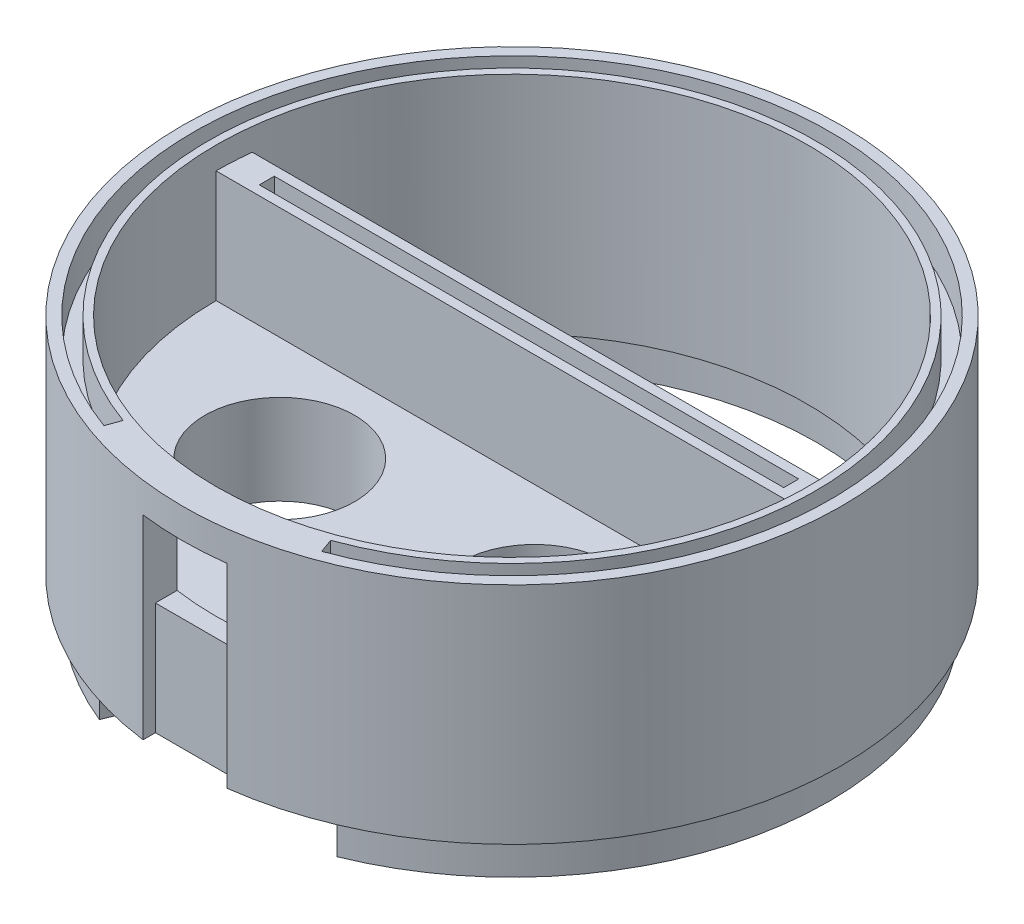
ISO-10303-21;
HEADER;
FILE_DESCRIPTION(('STEP AP214'),'2;1');
FILE_NAME('part.step','',(''),(''),'','','');
FILE_SCHEMA(('AUTOMOTIVE_DESIGN { 1 0 10303 214 1 1 1 1 }'));
ENDSEC;
DATA;
#1=APPLICATION_CONTEXT('core data for automotive mechanical design processes');
#2=APPLICATION_PROTOCOL_DEFINITION('international standard','automotive_design',2000,#1);
#3=PRODUCT_CONTEXT('',#1,'mechanical');
#4=PRODUCT('Part','Part','',(#3));
#5=PRODUCT_RELATED_PRODUCT_CATEGORY('part','',(#4));
#6=PRODUCT_DEFINITION_FORMATION('','',#4);
#7=PRODUCT_DEFINITION_CONTEXT('part definition',#1,'design');
#8=PRODUCT_DEFINITION('design','',#6,#7);
#9=PRODUCT_DEFINITION_SHAPE('','',#8);
#10=(LENGTH_UNIT() NAMED_UNIT(*) SI_UNIT(.MILLI.,.METRE.));
#11=(NAMED_UNIT(*) PLANE_ANGLE_UNIT() SI_UNIT($,.RADIAN.));
#12=(NAMED_UNIT(*) SI_UNIT($,.STERADIAN.) SOLID_ANGLE_UNIT());
#13=UNCERTAINTY_MEASURE_WITH_UNIT(LENGTH_MEASURE(1.E-05),#10,'distance_accuracy_value','');
#14=(GEOMETRIC_REPRESENTATION_CONTEXT(3) GLOBAL_UNCERTAINTY_ASSIGNED_CONTEXT((#13)) GLOBAL_UNIT_ASSIGNED_CONTEXT((#10,
#11,#12)) REPRESENTATION_CONTEXT('',''));
#15=CARTESIAN_POINT('',(0.,0.,0.));
#16=DIRECTION('',(0.,0.,1.));
#17=DIRECTION('',(1.,0.,0.));
#18=AXIS2_PLACEMENT_3D('',#15,#16,#17);
#19=CARTESIAN_POINT('',(0.,180.,0.));
#20=DIRECTION('',(0.,-1.,0.));
#21=DIRECTION('',(0.,0.,-1.));
#22=AXIS2_PLACEMENT_3D('',#19,#20,#21);
#23=CYLINDRICAL_SURFACE('',#22,44.);
#24=DIRECTION('',(0.,-1.,0.));
#25=VECTOR('',#24,1.);
#26=CARTESIAN_POINT('',(5.6,180.,43.6421814303547));
#27=LINE('',#26,#25);
#28=CARTESIAN_POINT('',(5.6,141.,43.6421814303547));
#29=VERTEX_POINT('',#28);
#30=CARTESIAN_POINT('',(5.6,167.,43.6421814303547));
#31=VERTEX_POINT('',#30);
#32=EDGE_CURVE('E356',#29,#31,#27,.F.);
#33=ORIENTED_EDGE('',*,*,#32,.F.);
#34=CARTESIAN_POINT('',(0.,141.,0.));
#35=DIRECTION('',(0.,1.,0.));
#36=DIRECTION('',(0.,0.,1.));
#37=AXIS2_PLACEMENT_3D('',#34,#35,#36);
#38=CIRCLE('',#37,44.);
#39=CARTESIAN_POINT('',(-5.6,141.,43.6421814303547));
#40=VERTEX_POINT('',#39);
#41=EDGE_CURVE('E290',#29,#40,#38,.T.);
#42=ORIENTED_EDGE('',*,*,#41,.T.);
#43=DIRECTION('',(0.,-1.,0.));
#44=VECTOR('',#43,1.);
#45=CARTESIAN_POINT('',(-5.6,180.,43.6421814303547));
#46=LINE('',#45,#44);
#47=CARTESIAN_POINT('',(-5.6,167.,43.6421814303547));
#48=VERTEX_POINT('',#47);
#49=EDGE_CURVE('E358',#48,#40,#46,.T.);
#50=ORIENTED_EDGE('',*,*,#49,.F.);
#51=CARTESIAN_POINT('',(0.,167.,0.));
#52=DIRECTION('',(0.,-1.,0.));
#53=DIRECTION('',(0.,0.,-1.));
#54=AXIS2_PLACEMENT_3D('',#51,#52,#53);
#55=CIRCLE('',#54,44.);
#56=EDGE_CURVE('E354',#31,#48,#55,.T.);
#57=ORIENTED_EDGE('',*,*,#56,.F.);
#58=EDGE_LOOP('',(#33,#42,#50,#57));
#59=FACE_BOUND('',#58,.T.);
#60=CARTESIAN_POINT('',(0.,171.,0.));
#61=DIRECTION('',(0.,1.,0.));
#62=DIRECTION('',(0.,0.,1.));
#63=AXIS2_PLACEMENT_3D('',#60,#61,#62);
#64=CIRCLE('',#63,44.);
#65=CARTESIAN_POINT('',(0.,171.,44.));
#66=VERTEX_POINT('',#65);
#67=EDGE_CURVE('E221',#66,#66,#64,.T.);
#68=ORIENTED_EDGE('',*,*,#67,.F.);
#69=EDGE_LOOP('',(#68));
#70=FACE_BOUND('',#69,.T.);
#71=ADVANCED_FACE('F36',(#59,#70),#23,.T.);
#72=CARTESIAN_POINT('',(0.,140.,0.));
#73=DIRECTION('',(0.,-1.,0.));
#74=DIRECTION('',(0.,0.,-1.));
#75=AXIS2_PLACEMENT_3D('',#72,#73,#74);
#76=CYLINDRICAL_SURFACE('',#75,39.5);
#77=CARTESIAN_POINT('',(0.,167.,0.));
#78=DIRECTION('',(0.,1.,0.));
#79=DIRECTION('',(0.,0.,1.));
#80=AXIS2_PLACEMENT_3D('',#77,#78,#79);
#81=CIRCLE('',#80,39.5);
#82=CARTESIAN_POINT('',(5.60000000000004,167.,39.10102300452));
#83=VERTEX_POINT('',#82);
#84=CARTESIAN_POINT('',(-5.6,167.,39.10102300452));
#85=VERTEX_POINT('',#84);
#86=EDGE_CURVE('E44',#83,#85,#81,.F.);
#87=ORIENTED_EDGE('',*,*,#86,.T.);
#88=DIRECTION('',(0.,1.,0.));
#89=VECTOR('',#88,1.);
#90=CARTESIAN_POINT('',(-5.6,168.,39.10102300452));
#91=LINE('',#90,#89);
#92=CARTESIAN_POINT('',(-5.6,156.,39.10102300452));
#93=VERTEX_POINT('',#92);
#94=EDGE_CURVE('E12',#85,#93,#91,.F.);
#95=ORIENTED_EDGE('',*,*,#94,.T.);
#96=CARTESIAN_POINT('',(0.,156.,0.));
#97=DIRECTION('',(0.,-1.,0.));
#98=DIRECTION('',(0.,0.,-1.));
#99=AXIS2_PLACEMENT_3D('',#96,#97,#98);
#100=CIRCLE('',#99,39.5);
#101=CARTESIAN_POINT('',(5.60000000000004,156.,39.10102300452));
#102=VERTEX_POINT('',#101);
#103=EDGE_CURVE('E364',#93,#102,#100,.F.);
#104=ORIENTED_EDGE('',*,*,#103,.T.);
#105=DIRECTION('',(0.,1.,0.));
#106=VECTOR('',#105,1.);
#107=CARTESIAN_POINT('',(5.60000000000004,168.,39.10102300452));
#108=LINE('',#107,#106);
#109=EDGE_CURVE('E367',#102,#83,#108,.T.);
#110=ORIENTED_EDGE('',*,*,#109,.T.);
#111=EDGE_LOOP('',(#87,#95,#104,#110));
#112=FACE_BOUND('',#111,.T.);
#113=CARTESIAN_POINT('',(0.,141.,0.));
#114=DIRECTION('',(0.,1.,0.));
#115=DIRECTION('',(0.,0.,1.));
#116=AXIS2_PLACEMENT_3D('',#113,#114,#115);
#117=CIRCLE('',#116,39.5);
#118=CARTESIAN_POINT('',(39.2349287961053,141.,-4.56840917219008));
#119=VERTEX_POINT('',#118);
#120=CARTESIAN_POINT('',(-39.2349287961053,141.,-4.56840917219008));
#121=VERTEX_POINT('',#120);
#122=EDGE_CURVE('E297',#119,#121,#117,.T.);
#123=ORIENTED_EDGE('',*,*,#122,.F.);
#124=DIRECTION('',(0.,1.,0.));
#125=VECTOR('',#124,1.);
#126=CARTESIAN_POINT('',(39.2349287961053,128.,-4.56840917219008));
#127=LINE('',#126,#125);
#128=CARTESIAN_POINT('',(39.2349287961053,168.,-4.56840917219008));
#129=VERTEX_POINT('',#128);
#130=EDGE_CURVE('E310',#119,#129,#127,.T.);
#131=ORIENTED_EDGE('',*,*,#130,.T.);
#132=CARTESIAN_POINT('',(0.,168.,0.));
#133=DIRECTION('',(0.,1.,0.));
#134=DIRECTION('',(0.,0.,1.));
#135=AXIS2_PLACEMENT_3D('',#132,#133,#134);
#136=CIRCLE('',#135,39.5);
#137=CARTESIAN_POINT('',(39.5,168.,0.));
#138=VERTEX_POINT('',#137);
#139=EDGE_CURVE('E342',#138,#129,#136,.T.);
#140=ORIENTED_EDGE('',*,*,#139,.F.);
#141=DIRECTION('',(0.,1.,0.));
#142=VECTOR('',#141,1.);
#143=CARTESIAN_POINT('',(39.5,153.,0.));
#144=LINE('',#143,#142);
#145=CARTESIAN_POINT('',(39.5,153.,0.));
#146=VERTEX_POINT('',#145);
#147=EDGE_CURVE('E336',#146,#138,#144,.T.);
#148=ORIENTED_EDGE('',*,*,#147,.F.);
#149=CARTESIAN_POINT('',(0.,153.,0.));
#150=DIRECTION('',(0.,1.,0.));
#151=DIRECTION('',(0.,0.,1.));
#152=AXIS2_PLACEMENT_3D('',#149,#150,#151);
#153=CIRCLE('',#152,39.5);
#154=CARTESIAN_POINT('',(-39.5,153.,0.));
#155=VERTEX_POINT('',#154);
#156=EDGE_CURVE('E330',#155,#146,#153,.T.);
#157=ORIENTED_EDGE('',*,*,#156,.F.);
#158=DIRECTION('',(0.,1.,0.));
#159=VECTOR('',#158,1.);
#160=CARTESIAN_POINT('',(-39.5,153.,0.));
#161=LINE('',#160,#159);
#162=CARTESIAN_POINT('',(-39.5,168.,0.));
#163=VERTEX_POINT('',#162);
#164=EDGE_CURVE('E337',#155,#163,#161,.T.);
#165=ORIENTED_EDGE('',*,*,#164,.T.);
#166=CARTESIAN_POINT('',(-39.2349287961053,168.,-4.56840917219008));
#167=VERTEX_POINT('',#166);
#168=EDGE_CURVE('E340',#167,#163,#136,.T.);
#169=ORIENTED_EDGE('',*,*,#168,.F.);
#170=DIRECTION('',(0.,1.,0.));
#171=VECTOR('',#170,1.);
#172=CARTESIAN_POINT('',(-39.2349287961053,128.,-4.56840917219008));
#173=LINE('',#172,#171);
#174=EDGE_CURVE('E309',#121,#167,#173,.T.);
#175=ORIENTED_EDGE('',*,*,#174,.F.);
#176=EDGE_LOOP('',(#123,#131,#140,#148,#157,#165,#169,#175));
#177=FACE_BOUND('',#176,.T.);
#178=CARTESIAN_POINT('',(0.,171.,0.));
#179=DIRECTION('',(0.,1.,0.));
#180=DIRECTION('',(0.,0.,1.));
#181=AXIS2_PLACEMENT_3D('',#178,#179,#180);
#182=CIRCLE('',#181,39.5);
#183=CARTESIAN_POINT('',(0.,171.,39.5));
#184=VERTEX_POINT('',#183);
#185=EDGE_CURVE('E39',#184,#184,#182,.T.);
#186=ORIENTED_EDGE('',*,*,#185,.T.);
#187=EDGE_LOOP('',(#186));
#188=FACE_BOUND('',#187,.T.);
#189=ADVANCED_FACE('F381',(#112,#177,#188),#76,.F.);
#190=CARTESIAN_POINT('',(0.,141.,0.));
#191=DIRECTION('',(0.,1.,0.));
#192=DIRECTION('',(0.,0.,1.));
#193=AXIS2_PLACEMENT_3D('',#190,#191,#192);
#194=PLANE('',#193);
#195=ORIENTED_EDGE('',*,*,#122,.T.);
#196=DIRECTION('',(-1.,0.,0.));
#197=VECTOR('',#196,1.);
#198=CARTESIAN_POINT('',(-34.7005711427845,141.,-4.56840917219008));
#199=LINE('',#198,#197);
#200=EDGE_CURVE('E299',#119,#121,#199,.T.);
#201=ORIENTED_EDGE('',*,*,#200,.F.);
#202=EDGE_LOOP('',(#195,#201));
#203=FACE_BOUND('',#202,.T.);
#204=CARTESIAN_POINT('',(17.,141.,14.));
#205=DIRECTION('',(0.,1.,0.));
#206=DIRECTION('',(0.,0.,1.));
#207=AXIS2_PLACEMENT_3D('',#204,#205,#206);
#208=CIRCLE('',#207,10.);
#209=CARTESIAN_POINT('',(17.,141.,24.));
#210=VERTEX_POINT('',#209);
#211=EDGE_CURVE('E294',#210,#210,#208,.F.);
#212=ORIENTED_EDGE('',*,*,#211,.F.);
#213=EDGE_LOOP('',(#212));
#214=FACE_BOUND('',#213,.T.);
#215=CARTESIAN_POINT('',(-17.,141.,14.));
#216=DIRECTION('',(0.,1.,0.));
#217=DIRECTION('',(0.,0.,1.));
#218=AXIS2_PLACEMENT_3D('',#215,#216,#217);
#219=CIRCLE('',#218,10.);
#220=CARTESIAN_POINT('',(-17.,141.,24.));
#221=VERTEX_POINT('',#220);
#222=EDGE_CURVE('E293',#221,#221,#219,.F.);
#223=ORIENTED_EDGE('',*,*,#222,.F.);
#224=EDGE_LOOP('',(#223));
#225=FACE_BOUND('',#224,.T.);
#226=DIRECTION('',(0.,0.,1.));
#227=VECTOR('',#226,1.);
#228=CARTESIAN_POINT('',(-5.6,141.,55.6));
#229=LINE('',#228,#227);
#230=CARTESIAN_POINT('',(-5.6,141.,42.));
#231=VERTEX_POINT('',#230);
#232=EDGE_CURVE('E307',#231,#40,#229,.T.);
#233=ORIENTED_EDGE('',*,*,#232,.T.);
#234=ORIENTED_EDGE('',*,*,#41,.F.);
#235=DIRECTION('',(0.,0.,-1.));
#236=VECTOR('',#235,1.);
#237=CARTESIAN_POINT('',(5.60000000000001,141.,55.6));
#238=LINE('',#237,#236);
#239=CARTESIAN_POINT('',(5.60000000000001,141.,42.));
#240=VERTEX_POINT('',#239);
#241=EDGE_CURVE('E302',#29,#240,#238,.T.);
#242=ORIENTED_EDGE('',*,*,#241,.T.);
#243=DIRECTION('',(1.,0.,0.));
#244=VECTOR('',#243,1.);
#245=CARTESIAN_POINT('',(0.,141.,42.));
#246=LINE('',#245,#244);
#247=EDGE_CURVE('E304',#231,#240,#246,.T.);
#248=ORIENTED_EDGE('',*,*,#247,.F.);
#249=EDGE_LOOP('',(#233,#234,#242,#248));
#250=FACE_BOUND('',#249,.T.);
#251=CARTESIAN_POINT('',(0.,141.,0.));
#252=DIRECTION('',(0.,1.,0.));
#253=DIRECTION('',(0.,0.,-1.));
#254=AXIS2_PLACEMENT_3D('',#251,#252,#253);
#255=CIRCLE('',#254,40.7);
#256=CARTESIAN_POINT('',(15.2464883520277,141.,37.7363828808682));
#257=VERTEX_POINT('',#256);
#258=CARTESIAN_POINT('',(-15.2464883520276,141.,37.7363828808682));
#259=VERTEX_POINT('',#258);
#260=EDGE_CURVE('E252',#257,#259,#255,.T.);
#261=ORIENTED_EDGE('',*,*,#260,.F.);
#262=DIRECTION('',(-0.374606593415912,0.,-0.927183854566788));
#263=VECTOR('',#262,1.);
#264=CARTESIAN_POINT('',(15.2464883520277,141.,37.7363828808682));
#265=LINE('',#264,#263);
#266=CARTESIAN_POINT('',(15.8458589014931,141.,39.2198770481751));
#267=VERTEX_POINT('',#266);
#268=EDGE_CURVE('E262',#267,#257,#265,.T.);
#269=ORIENTED_EDGE('',*,*,#268,.F.);
#270=CARTESIAN_POINT('',(0.,141.,0.));
#271=DIRECTION('',(0.,-1.,0.));
#272=DIRECTION('',(0.,0.,-1.));
#273=AXIS2_PLACEMENT_3D('',#270,#271,#272);
#274=CIRCLE('',#273,42.3);
#275=CARTESIAN_POINT('',(-15.8458589014931,141.,39.2198770481751));
#276=VERTEX_POINT('',#275);
#277=EDGE_CURVE('E274',#276,#267,#274,.T.);
#278=ORIENTED_EDGE('',*,*,#277,.F.);
#279=DIRECTION('',(-0.374606593415912,0.,0.927183854566788));
#280=VECTOR('',#279,1.);
#281=CARTESIAN_POINT('',(-15.2464883520277,141.,37.7363828808682));
#282=LINE('',#281,#280);
#283=EDGE_CURVE('E271',#259,#276,#282,.T.);
#284=ORIENTED_EDGE('',*,*,#283,.F.);
#285=EDGE_LOOP('',(#261,#269,#278,#284));
#286=FACE_BOUND('',#285,.T.);
#287=ADVANCED_FACE('F377',(#203,#214,#225,#250,#286),#194,.F.);
#288=CARTESIAN_POINT('',(0.,0.,42.));
#289=DIRECTION('',(0.,0.,-1.));
#290=DIRECTION('',(-1.,0.,0.));
#291=AXIS2_PLACEMENT_3D('',#288,#289,#290);
#292=PLANE('',#291);
#293=DIRECTION('',(0.,-1.,0.));
#294=VECTOR('',#293,1.);
#295=CARTESIAN_POINT('',(-5.6,10.2975033618753,42.));
#296=LINE('',#295,#294);
#297=CARTESIAN_POINT('',(-5.6,156.,42.));
#298=VERTEX_POINT('',#297);
#299=EDGE_CURVE('E345',#298,#231,#296,.T.);
#300=ORIENTED_EDGE('',*,*,#299,.T.);
#301=ORIENTED_EDGE('',*,*,#247,.T.);
#302=DIRECTION('',(0.,1.,0.));
#303=VECTOR('',#302,1.);
#304=CARTESIAN_POINT('',(5.60000000000004,10.2975033618753,42.));
#305=LINE('',#304,#303);
#306=CARTESIAN_POINT('',(5.60000000000004,156.,42.));
#307=VERTEX_POINT('',#306);
#308=EDGE_CURVE('E348',#240,#307,#305,.T.);
#309=ORIENTED_EDGE('',*,*,#308,.T.);
#310=DIRECTION('',(1.,0.,0.));
#311=VECTOR('',#310,1.);
#312=CARTESIAN_POINT('',(-5.6,156.,42.));
#313=LINE('',#312,#311);
#314=EDGE_CURVE('E312',#298,#307,#313,.T.);
#315=ORIENTED_EDGE('',*,*,#314,.F.);
#316=EDGE_LOOP('',(#300,#301,#309,#315));
#317=FACE_BOUND('',#316,.T.);
#318=ADVANCED_FACE('F380',(#317),#292,.F.);
#319=CARTESIAN_POINT('',(-5.6,10.2975033618753,55.6));
#320=DIRECTION('',(1.,0.,0.));
#321=DIRECTION('',(0.,0.,-1.));
#322=AXIS2_PLACEMENT_3D('',#319,#320,#321);
#323=PLANE('',#322);
#324=ORIENTED_EDGE('',*,*,#232,.F.);
#325=ORIENTED_EDGE('',*,*,#299,.F.);
#326=DIRECTION('',(0.,0.,1.));
#327=VECTOR('',#326,1.);
#328=CARTESIAN_POINT('',(-5.6,156.,28.));
#329=LINE('',#328,#327);
#330=EDGE_CURVE('E316',#93,#298,#329,.T.);
#331=ORIENTED_EDGE('',*,*,#330,.F.);
#332=ORIENTED_EDGE('',*,*,#94,.F.);
#333=DIRECTION('',(0.,0.,-1.));
#334=VECTOR('',#333,1.);
#335=CARTESIAN_POINT('',(-5.6,167.,55.6));
#336=LINE('',#335,#334);
#337=EDGE_CURVE('E350',#48,#85,#336,.T.);
#338=ORIENTED_EDGE('',*,*,#337,.F.);
#339=ORIENTED_EDGE('',*,*,#49,.T.);
#340=EDGE_LOOP('',(#324,#325,#331,#332,#338,#339));
#341=FACE_BOUND('',#340,.T.);
#342=ADVANCED_FACE('F563',(#341),#323,.T.);
#343=CARTESIAN_POINT('',(5.60000000000004,10.2975033618753,55.6));
#344=DIRECTION('',(-1.,0.,0.));
#345=DIRECTION('',(0.,-1.,0.));
#346=AXIS2_PLACEMENT_3D('',#343,#344,#345);
#347=PLANE('',#346);
#348=ORIENTED_EDGE('',*,*,#241,.F.);
#349=ORIENTED_EDGE('',*,*,#32,.T.);
#350=DIRECTION('',(0.,0.,-1.));
#351=VECTOR('',#350,1.);
#352=CARTESIAN_POINT('',(5.6,167.,55.6));
#353=LINE('',#352,#351);
#354=EDGE_CURVE('E352',#31,#83,#353,.T.);
#355=ORIENTED_EDGE('',*,*,#354,.T.);
#356=ORIENTED_EDGE('',*,*,#109,.F.);
#357=DIRECTION('',(0.,0.,1.));
#358=VECTOR('',#357,1.);
#359=CARTESIAN_POINT('',(5.60000000000004,156.,28.));
#360=LINE('',#359,#358);
#361=EDGE_CURVE('E317',#102,#307,#360,.T.);
#362=ORIENTED_EDGE('',*,*,#361,.T.);
#363=ORIENTED_EDGE('',*,*,#308,.F.);
#364=EDGE_LOOP('',(#348,#349,#355,#356,#362,#363));
#365=FACE_BOUND('',#364,.T.);
#366=ADVANCED_FACE('F572',(#365),#347,.T.);
#367=CARTESIAN_POINT('',(-5.6,167.,55.6));
#368=DIRECTION('',(0.,-1.,0.));
#369=DIRECTION('',(0.,0.,-1.));
#370=AXIS2_PLACEMENT_3D('',#367,#368,#369);
#371=PLANE('',#370);
#372=ORIENTED_EDGE('',*,*,#56,.T.);
#373=ORIENTED_EDGE('',*,*,#337,.T.);
#374=ORIENTED_EDGE('',*,*,#86,.F.);
#375=ORIENTED_EDGE('',*,*,#354,.F.);
#376=EDGE_LOOP('',(#372,#373,#374,#375));
#377=FACE_BOUND('',#376,.T.);
#378=ADVANCED_FACE('F580',(#377),#371,.T.);
#379=CARTESIAN_POINT('',(0.,168.,0.));
#380=DIRECTION('',(0.,1.,0.));
#381=DIRECTION('',(0.,0.,1.));
#382=AXIS2_PLACEMENT_3D('',#379,#380,#381);
#383=PLANE('',#382);
#384=DIRECTION('',(0.,0.,-1.));
#385=VECTOR('',#384,1.);
#386=CARTESIAN_POINT('',(35.,168.,-1.26840917219008));
#387=LINE('',#386,#385);
#388=CARTESIAN_POINT('',(35.,168.,-1.26840917219008));
#389=VERTEX_POINT('',#388);
#390=CARTESIAN_POINT('',(35.,168.,-3.26840917219008));
#391=VERTEX_POINT('',#390);
#392=EDGE_CURVE('E60',#389,#391,#387,.T.);
#393=ORIENTED_EDGE('',*,*,#392,.F.);
#394=DIRECTION('',(1.,0.,0.));
#395=VECTOR('',#394,1.);
#396=CARTESIAN_POINT('',(35.,168.,-1.26840917219008));
#397=LINE('',#396,#395);
#398=CARTESIAN_POINT('',(-35.,168.,-1.26840917219008));
#399=VERTEX_POINT('',#398);
#400=EDGE_CURVE('E231',#399,#389,#397,.T.);
#401=ORIENTED_EDGE('',*,*,#400,.F.);
#402=DIRECTION('',(0.,0.,1.));
#403=VECTOR('',#402,1.);
#404=CARTESIAN_POINT('',(-35.,168.,-1.26840917219008));
#405=LINE('',#404,#403);
#406=CARTESIAN_POINT('',(-35.,168.,-3.26840917219007));
#407=VERTEX_POINT('',#406);
#408=EDGE_CURVE('E245',#407,#399,#405,.T.);
#409=ORIENTED_EDGE('',*,*,#408,.F.);
#410=DIRECTION('',(-1.,0.,0.));
#411=VECTOR('',#410,1.);
#412=CARTESIAN_POINT('',(35.,168.,-3.26840917219008));
#413=LINE('',#412,#411);
#414=EDGE_CURVE('E242',#391,#407,#413,.T.);
#415=ORIENTED_EDGE('',*,*,#414,.F.);
#416=EDGE_LOOP('',(#393,#401,#409,#415));
#417=FACE_BOUND('',#416,.T.);
#418=ORIENTED_EDGE('',*,*,#139,.T.);
#419=DIRECTION('',(1.,0.,0.));
#420=VECTOR('',#419,1.);
#421=CARTESIAN_POINT('',(-34.7005711427845,168.,-4.56840917219008));
#422=LINE('',#421,#420);
#423=EDGE_CURVE('E325',#167,#129,#422,.T.);
#424=ORIENTED_EDGE('',*,*,#423,.F.);
#425=ORIENTED_EDGE('',*,*,#168,.T.);
#426=DIRECTION('',(-1.,0.,0.));
#427=VECTOR('',#426,1.);
#428=CARTESIAN_POINT('',(0.,168.,0.));
#429=LINE('',#428,#427);
#430=EDGE_CURVE('E361',#138,#163,#429,.T.);
#431=ORIENTED_EDGE('',*,*,#430,.F.);
#432=EDGE_LOOP('',(#418,#424,#425,#431));
#433=FACE_BOUND('',#432,.T.);
#434=ADVANCED_FACE('F589',(#417,#433),#383,.T.);
#435=CARTESIAN_POINT('',(-39.5,153.,0.));
#436=DIRECTION('',(0.,0.,-1.));
#437=DIRECTION('',(-1.,0.,0.));
#438=AXIS2_PLACEMENT_3D('',#435,#436,#437);
#439=PLANE('',#438);
#440=ORIENTED_EDGE('',*,*,#430,.T.);
#441=ORIENTED_EDGE('',*,*,#164,.F.);
#442=DIRECTION('',(-1.,0.,0.));
#443=VECTOR('',#442,1.);
#444=CARTESIAN_POINT('',(-39.5,153.,0.));
#445=LINE('',#444,#443);
#446=EDGE_CURVE('E333',#146,#155,#445,.T.);
#447=ORIENTED_EDGE('',*,*,#446,.F.);
#448=ORIENTED_EDGE('',*,*,#147,.T.);
#449=EDGE_LOOP('',(#440,#441,#447,#448));
#450=FACE_BOUND('',#449,.T.);
#451=ADVANCED_FACE('F597',(#450),#439,.F.);
#452=CARTESIAN_POINT('',(0.,153.,0.));
#453=DIRECTION('',(0.,1.,0.));
#454=DIRECTION('',(0.,0.,1.));
#455=AXIS2_PLACEMENT_3D('',#452,#453,#454);
#456=PLANE('',#455);
#457=CARTESIAN_POINT('',(-17.,153.,14.));
#458=DIRECTION('',(0.,1.,0.));
#459=DIRECTION('',(0.,0.,1.));
#460=AXIS2_PLACEMENT_3D('',#457,#458,#459);
#461=CIRCLE('',#460,10.);
#462=CARTESIAN_POINT('',(-17.,153.,24.));
#463=VERTEX_POINT('',#462);
#464=EDGE_CURVE('E322',#463,#463,#461,.T.);
#465=ORIENTED_EDGE('',*,*,#464,.F.);
#466=EDGE_LOOP('',(#465));
#467=FACE_BOUND('',#466,.T.);
#468=CARTESIAN_POINT('',(17.,153.,14.));
#469=DIRECTION('',(0.,1.,0.));
#470=DIRECTION('',(0.,0.,-1.));
#471=AXIS2_PLACEMENT_3D('',#468,#469,#470);
#472=CIRCLE('',#471,10.);
#473=CARTESIAN_POINT('',(17.,153.,4.));
#474=VERTEX_POINT('',#473);
#475=EDGE_CURVE('E320',#474,#474,#472,.T.);
#476=ORIENTED_EDGE('',*,*,#475,.F.);
#477=EDGE_LOOP('',(#476));
#478=FACE_BOUND('',#477,.T.);
#479=ORIENTED_EDGE('',*,*,#156,.T.);
#480=ORIENTED_EDGE('',*,*,#446,.T.);
#481=EDGE_LOOP('',(#479,#480));
#482=FACE_BOUND('',#481,.T.);
#483=ADVANCED_FACE('F605',(#467,#478,#482),#456,.T.);
#484=CARTESIAN_POINT('',(-34.7005711427845,118.,-4.56840917219008));
#485=DIRECTION('',(0.,0.,1.));
#486=DIRECTION('',(1.,0.,0.));
#487=AXIS2_PLACEMENT_3D('',#484,#485,#486);
#488=PLANE('',#487);
#489=ORIENTED_EDGE('',*,*,#130,.F.);
#490=ORIENTED_EDGE('',*,*,#200,.T.);
#491=ORIENTED_EDGE('',*,*,#174,.T.);
#492=ORIENTED_EDGE('',*,*,#423,.T.);
#493=EDGE_LOOP('',(#489,#490,#491,#492));
#494=FACE_BOUND('',#493,.T.);
#495=ADVANCED_FACE('F613',(#494),#488,.F.);
#496=CARTESIAN_POINT('',(17.,137.,14.));
#497=DIRECTION('',(0.,1.,0.));
#498=DIRECTION('',(0.,0.,1.));
#499=AXIS2_PLACEMENT_3D('',#496,#497,#498);
#500=CYLINDRICAL_SURFACE('',#499,10.);
#501=ORIENTED_EDGE('',*,*,#211,.T.);
#502=EDGE_LOOP('',(#501));
#503=FACE_BOUND('',#502,.T.);
#504=ORIENTED_EDGE('',*,*,#475,.T.);
#505=EDGE_LOOP('',(#504));
#506=FACE_BOUND('',#505,.T.);
#507=ADVANCED_FACE('F619',(#503,#506),#500,.F.);
#508=CARTESIAN_POINT('',(-17.,137.,14.));
#509=DIRECTION('',(0.,1.,0.));
#510=DIRECTION('',(0.,0.,1.));
#511=AXIS2_PLACEMENT_3D('',#508,#509,#510);
#512=CYLINDRICAL_SURFACE('',#511,10.);
#513=ORIENTED_EDGE('',*,*,#222,.T.);
#514=EDGE_LOOP('',(#513));
#515=FACE_BOUND('',#514,.T.);
#516=ORIENTED_EDGE('',*,*,#464,.T.);
#517=EDGE_LOOP('',(#516));
#518=FACE_BOUND('',#517,.T.);
#519=ADVANCED_FACE('F374',(#515,#518),#512,.F.);
#520=CARTESIAN_POINT('',(-5.6,156.,28.));
#521=DIRECTION('',(0.,-1.,0.));
#522=DIRECTION('',(0.,0.,-1.));
#523=AXIS2_PLACEMENT_3D('',#520,#521,#522);
#524=PLANE('',#523);
#525=ORIENTED_EDGE('',*,*,#330,.T.);
#526=ORIENTED_EDGE('',*,*,#314,.T.);
#527=ORIENTED_EDGE('',*,*,#361,.F.);
#528=ORIENTED_EDGE('',*,*,#103,.F.);
#529=EDGE_LOOP('',(#525,#526,#527,#528));
#530=FACE_BOUND('',#529,.T.);
#531=ADVANCED_FACE('F410',(#530),#524,.F.);
#532=CARTESIAN_POINT('',(0.,136.,0.));
#533=DIRECTION('',(0.,1.,0.));
#534=DIRECTION('',(0.,0.,1.));
#535=AXIS2_PLACEMENT_3D('',#532,#533,#534);
#536=CYLINDRICAL_SURFACE('',#535,40.7);
#537=ORIENTED_EDGE('',*,*,#260,.T.);
#538=DIRECTION('',(0.,1.,0.));
#539=VECTOR('',#538,1.);
#540=CARTESIAN_POINT('',(-15.2464883520277,136.,37.7363828808682));
#541=LINE('',#540,#539);
#542=CARTESIAN_POINT('',(-15.2464883520277,136.,37.7363828808682));
#543=VERTEX_POINT('',#542);
#544=EDGE_CURVE('E287',#543,#259,#541,.T.);
#545=ORIENTED_EDGE('',*,*,#544,.F.);
#546=CARTESIAN_POINT('',(0.,136.,0.));
#547=DIRECTION('',(0.,1.,0.));
#548=DIRECTION('',(0.,0.,-1.));
#549=AXIS2_PLACEMENT_3D('',#546,#547,#548);
#550=CIRCLE('',#549,40.7);
#551=CARTESIAN_POINT('',(15.2464883520277,136.,37.7363828808682));
#552=VERTEX_POINT('',#551);
#553=EDGE_CURVE('E258',#552,#543,#550,.T.);
#554=ORIENTED_EDGE('',*,*,#553,.F.);
#555=DIRECTION('',(0.,1.,0.));
#556=VECTOR('',#555,1.);
#557=CARTESIAN_POINT('',(15.2464883520277,136.,37.7363828808682));
#558=LINE('',#557,#556);
#559=EDGE_CURVE('E268',#552,#257,#558,.T.);
#560=ORIENTED_EDGE('',*,*,#559,.T.);
#561=EDGE_LOOP('',(#537,#545,#554,#560));
#562=FACE_BOUND('',#561,.T.);
#563=ADVANCED_FACE('F394',(#562),#536,.F.);
#564=CARTESIAN_POINT('',(-15.2464883520277,136.,37.7363828808682));
#565=DIRECTION('',(-0.927183854566788,0.,-0.374606593415912));
#566=DIRECTION('',(-0.374606593415912,0.,0.927183854566788));
#567=AXIS2_PLACEMENT_3D('',#564,#565,#566);
#568=PLANE('',#567);
#569=ORIENTED_EDGE('',*,*,#283,.T.);
#570=DIRECTION('',(0.,1.,0.));
#571=VECTOR('',#570,1.);
#572=CARTESIAN_POINT('',(-15.8458589014931,136.,39.2198770481751));
#573=LINE('',#572,#571);
#574=CARTESIAN_POINT('',(-15.8458589014931,136.,39.2198770481751));
#575=VERTEX_POINT('',#574);
#576=EDGE_CURVE('E284',#575,#276,#573,.T.);
#577=ORIENTED_EDGE('',*,*,#576,.F.);
#578=DIRECTION('',(-0.374606593415912,0.,0.927183854566788));
#579=VECTOR('',#578,1.);
#580=CARTESIAN_POINT('',(-15.2464883520277,136.,37.7363828808682));
#581=LINE('',#580,#579);
#582=EDGE_CURVE('E261',#543,#575,#581,.T.);
#583=ORIENTED_EDGE('',*,*,#582,.F.);
#584=ORIENTED_EDGE('',*,*,#544,.T.);
#585=EDGE_LOOP('',(#569,#577,#583,#584));
#586=FACE_BOUND('',#585,.T.);
#587=ADVANCED_FACE('F402',(#586),#568,.F.);
#588=CARTESIAN_POINT('',(0.,136.,0.));
#589=DIRECTION('',(0.,1.,0.));
#590=DIRECTION('',(0.,0.,1.));
#591=AXIS2_PLACEMENT_3D('',#588,#589,#590);
#592=CYLINDRICAL_SURFACE('',#591,42.3);
#593=ORIENTED_EDGE('',*,*,#277,.T.);
#594=DIRECTION('',(0.,1.,0.));
#595=VECTOR('',#594,1.);
#596=CARTESIAN_POINT('',(15.8458589014931,136.,39.2198770481751));
#597=LINE('',#596,#595);
#598=CARTESIAN_POINT('',(15.8458589014931,136.,39.2198770481751));
#599=VERTEX_POINT('',#598);
#600=EDGE_CURVE('E281',#599,#267,#597,.T.);
#601=ORIENTED_EDGE('',*,*,#600,.F.);
#602=CARTESIAN_POINT('',(0.,136.,0.));
#603=DIRECTION('',(0.,-1.,0.));
#604=DIRECTION('',(0.,0.,-1.));
#605=AXIS2_PLACEMENT_3D('',#602,#603,#604);
#606=CIRCLE('',#605,42.3);
#607=EDGE_CURVE('E264',#575,#599,#606,.T.);
#608=ORIENTED_EDGE('',*,*,#607,.F.);
#609=ORIENTED_EDGE('',*,*,#576,.T.);
#610=EDGE_LOOP('',(#593,#601,#608,#609));
#611=FACE_BOUND('',#610,.T.);
#612=ADVANCED_FACE('F400',(#611),#592,.T.);
#613=CARTESIAN_POINT('',(15.2464883520277,136.,37.7363828808682));
#614=DIRECTION('',(0.927183854566788,0.,-0.374606593415912));
#615=DIRECTION('',(-0.374606593415912,0.,-0.927183854566788));
#616=AXIS2_PLACEMENT_3D('',#613,#614,#615);
#617=PLANE('',#616);
#618=ORIENTED_EDGE('',*,*,#268,.T.);
#619=ORIENTED_EDGE('',*,*,#559,.F.);
#620=DIRECTION('',(-0.374606593415912,0.,-0.927183854566788));
#621=VECTOR('',#620,1.);
#622=CARTESIAN_POINT('',(15.2464883520277,136.,37.7363828808682));
#623=LINE('',#622,#621);
#624=EDGE_CURVE('E266',#599,#552,#623,.T.);
#625=ORIENTED_EDGE('',*,*,#624,.F.);
#626=ORIENTED_EDGE('',*,*,#600,.T.);
#627=EDGE_LOOP('',(#618,#619,#625,#626));
#628=FACE_BOUND('',#627,.T.);
#629=ADVANCED_FACE('F390',(#628),#617,.F.);
#630=CARTESIAN_POINT('',(0.,136.,0.));
#631=DIRECTION('',(0.,-1.,0.));
#632=DIRECTION('',(0.,0.,-1.));
#633=AXIS2_PLACEMENT_3D('',#630,#631,#632);
#634=PLANE('',#633);
#635=ORIENTED_EDGE('',*,*,#553,.T.);
#636=ORIENTED_EDGE('',*,*,#582,.T.);
#637=ORIENTED_EDGE('',*,*,#607,.T.);
#638=ORIENTED_EDGE('',*,*,#624,.T.);
#639=EDGE_LOOP('',(#635,#636,#637,#638));
#640=FACE_BOUND('',#639,.T.);
#641=ADVANCED_FACE('F396',(#640),#634,.T.);
#642=CARTESIAN_POINT('',(35.,163.,-1.26840917219008));
#643=DIRECTION('',(1.,0.,0.));
#644=DIRECTION('',(0.,0.,-1.));
#645=AXIS2_PLACEMENT_3D('',#642,#643,#644);
#646=PLANE('',#645);
#647=ORIENTED_EDGE('',*,*,#392,.T.);
#648=DIRECTION('',(0.,1.,0.));
#649=VECTOR('',#648,1.);
#650=CARTESIAN_POINT('',(35.,163.,-3.26840917219008));
#651=LINE('',#650,#649);
#652=CARTESIAN_POINT('',(35.,163.,-3.26840917219008));
#653=VERTEX_POINT('',#652);
#654=EDGE_CURVE('E240',#653,#391,#651,.T.);
#655=ORIENTED_EDGE('',*,*,#654,.F.);
#656=DIRECTION('',(0.,0.,-1.));
#657=VECTOR('',#656,1.);
#658=CARTESIAN_POINT('',(35.,163.,-1.26840917219008));
#659=LINE('',#658,#657);
#660=CARTESIAN_POINT('',(35.,163.,-1.26840917219008));
#661=VERTEX_POINT('',#660);
#662=EDGE_CURVE('E227',#661,#653,#659,.T.);
#663=ORIENTED_EDGE('',*,*,#662,.F.);
#664=DIRECTION('',(0.,1.,0.));
#665=VECTOR('',#664,1.);
#666=CARTESIAN_POINT('',(35.,163.,-1.26840917219008));
#667=LINE('',#666,#665);
#668=EDGE_CURVE('E250',#661,#389,#667,.T.);
#669=ORIENTED_EDGE('',*,*,#668,.T.);
#670=EDGE_LOOP('',(#647,#655,#663,#669));
#671=FACE_BOUND('',#670,.T.);
#672=ADVANCED_FACE('F444',(#671),#646,.F.);
#673=CARTESIAN_POINT('',(35.,163.,-1.26840917219008));
#674=DIRECTION('',(0.,0.,1.));
#675=DIRECTION('',(1.,0.,0.));
#676=AXIS2_PLACEMENT_3D('',#673,#674,#675);
#677=PLANE('',#676);
#678=ORIENTED_EDGE('',*,*,#400,.T.);
#679=ORIENTED_EDGE('',*,*,#668,.F.);
#680=DIRECTION('',(1.,0.,0.));
#681=VECTOR('',#680,1.);
#682=CARTESIAN_POINT('',(35.,163.,-1.26840917219008));
#683=LINE('',#682,#681);
#684=CARTESIAN_POINT('',(-35.,163.,-1.26840917219008));
#685=VERTEX_POINT('',#684);
#686=EDGE_CURVE('E237',#685,#661,#683,.T.);
#687=ORIENTED_EDGE('',*,*,#686,.F.);
#688=DIRECTION('',(0.,1.,0.));
#689=VECTOR('',#688,1.);
#690=CARTESIAN_POINT('',(-35.,163.,-1.26840917219008));
#691=LINE('',#690,#689);
#692=EDGE_CURVE('E253',#685,#399,#691,.T.);
#693=ORIENTED_EDGE('',*,*,#692,.T.);
#694=EDGE_LOOP('',(#678,#679,#687,#693));
#695=FACE_BOUND('',#694,.T.);
#696=ADVANCED_FACE('F440',(#695),#677,.F.);
#697=CARTESIAN_POINT('',(-35.,163.,-1.26840917219008));
#698=DIRECTION('',(-1.,0.,0.));
#699=DIRECTION('',(0.,0.,1.));
#700=AXIS2_PLACEMENT_3D('',#697,#698,#699);
#701=PLANE('',#700);
#702=ORIENTED_EDGE('',*,*,#408,.T.);
#703=ORIENTED_EDGE('',*,*,#692,.F.);
#704=DIRECTION('',(0.,0.,1.));
#705=VECTOR('',#704,1.);
#706=CARTESIAN_POINT('',(-35.,163.,-1.26840917219008));
#707=LINE('',#706,#705);
#708=CARTESIAN_POINT('',(-35.,163.,-3.26840917219007));
#709=VERTEX_POINT('',#708);
#710=EDGE_CURVE('E234',#709,#685,#707,.T.);
#711=ORIENTED_EDGE('',*,*,#710,.F.);
#712=DIRECTION('',(0.,1.,0.));
#713=VECTOR('',#712,1.);
#714=CARTESIAN_POINT('',(-35.,163.,-3.26840917219007));
#715=LINE('',#714,#713);
#716=EDGE_CURVE('E255',#709,#407,#715,.T.);
#717=ORIENTED_EDGE('',*,*,#716,.T.);
#718=EDGE_LOOP('',(#702,#703,#711,#717));
#719=FACE_BOUND('',#718,.T.);
#720=ADVANCED_FACE('F443',(#719),#701,.F.);
#721=CARTESIAN_POINT('',(35.,163.,-3.26840917219008));
#722=DIRECTION('',(0.,0.,-1.));
#723=DIRECTION('',(-1.,0.,0.));
#724=AXIS2_PLACEMENT_3D('',#721,#722,#723);
#725=PLANE('',#724);
#726=ORIENTED_EDGE('',*,*,#414,.T.);
#727=ORIENTED_EDGE('',*,*,#716,.F.);
#728=DIRECTION('',(-1.,0.,0.));
#729=VECTOR('',#728,1.);
#730=CARTESIAN_POINT('',(35.,163.,-3.26840917219008));
#731=LINE('',#730,#729);
#732=EDGE_CURVE('E230',#653,#709,#731,.T.);
#733=ORIENTED_EDGE('',*,*,#732,.F.);
#734=ORIENTED_EDGE('',*,*,#654,.T.);
#735=EDGE_LOOP('',(#726,#727,#733,#734));
#736=FACE_BOUND('',#735,.T.);
#737=ADVANCED_FACE('F434',(#736),#725,.F.);
#738=CARTESIAN_POINT('',(0.,163.,0.));
#739=DIRECTION('',(0.,1.,0.));
#740=DIRECTION('',(0.,0.,1.));
#741=AXIS2_PLACEMENT_3D('',#738,#739,#740);
#742=PLANE('',#741);
#743=ORIENTED_EDGE('',*,*,#662,.T.);
#744=ORIENTED_EDGE('',*,*,#732,.T.);
#745=ORIENTED_EDGE('',*,*,#710,.T.);
#746=ORIENTED_EDGE('',*,*,#686,.T.);
#747=EDGE_LOOP('',(#743,#744,#745,#746));
#748=FACE_BOUND('',#747,.T.);
#749=ADVANCED_FACE('F425',(#748),#742,.T.);
#750=CARTESIAN_POINT('',(0.,171.,0.));
#751=DIRECTION('',(0.,1.,0.));
#752=DIRECTION('',(0.,0.,1.));
#753=AXIS2_PLACEMENT_3D('',#750,#751,#752);
#754=PLANE('',#753);
#755=CARTESIAN_POINT('',(0.,171.,0.));
#756=DIRECTION('',(0.,-1.,0.));
#757=DIRECTION('',(0.,0.,1.));
#758=AXIS2_PLACEMENT_3D('',#755,#756,#757);
#759=CIRCLE('',#758,40.5);
#760=CARTESIAN_POINT('',(-13.8518158046892,171.,38.0575511418294));
#761=VERTEX_POINT('',#760);
#762=CARTESIAN_POINT('',(13.8518158046901,171.,38.0575511418291));
#763=VERTEX_POINT('',#762);
#764=EDGE_CURVE('E52',#761,#763,#759,.T.);
#765=ORIENTED_EDGE('',*,*,#764,.F.);
#766=DIRECTION('',(0.342020143325868,0.,-0.939692620785836));
#767=VECTOR('',#766,1.);
#768=CARTESIAN_POINT('',(-14.535856091341,171.,39.9369363834011));
#769=LINE('',#768,#767);
#770=CARTESIAN_POINT('',(-14.535856091341,171.,39.9369363834011));
#771=VERTEX_POINT('',#770);
#772=EDGE_CURVE('E206',#771,#761,#769,.T.);
#773=ORIENTED_EDGE('',*,*,#772,.F.);
#774=CARTESIAN_POINT('',(0.,171.,0.));
#775=DIRECTION('',(0.,1.,0.));
#776=DIRECTION('',(0.,0.,1.));
#777=AXIS2_PLACEMENT_3D('',#774,#775,#776);
#778=CIRCLE('',#777,42.5);
#779=CARTESIAN_POINT('',(14.5358560913414,171.,39.9369363834009));
#780=VERTEX_POINT('',#779);
#781=EDGE_CURVE('E209',#780,#771,#778,.T.);
#782=ORIENTED_EDGE('',*,*,#781,.F.);
#783=DIRECTION('',(0.342020143325681,0.,0.939692620785904));
#784=VECTOR('',#783,1.);
#785=CARTESIAN_POINT('',(14.5358560913414,171.,39.9369363834009));
#786=LINE('',#785,#784);
#787=EDGE_CURVE('E215',#763,#780,#786,.T.);
#788=ORIENTED_EDGE('',*,*,#787,.F.);
#789=EDGE_LOOP('',(#765,#773,#782,#788));
#790=FACE_BOUND('',#789,.T.);
#791=ORIENTED_EDGE('',*,*,#185,.F.);
#792=EDGE_LOOP('',(#791));
#793=FACE_BOUND('',#792,.T.);
#794=ORIENTED_EDGE('',*,*,#67,.T.);
#795=EDGE_LOOP('',(#794));
#796=FACE_BOUND('',#795,.T.);
#797=ADVANCED_FACE('F423',(#790,#793,#796),#754,.T.);
#798=CARTESIAN_POINT('',(0.,166.,0.));
#799=DIRECTION('',(0.,1.,0.));
#800=DIRECTION('',(0.,0.,1.));
#801=AXIS2_PLACEMENT_3D('',#798,#799,#800);
#802=CYLINDRICAL_SURFACE('',#801,40.5);
#803=ORIENTED_EDGE('',*,*,#764,.T.);
#804=DIRECTION('',(0.,1.,0.));
#805=VECTOR('',#804,1.);
#806=CARTESIAN_POINT('',(13.85181580469,166.,38.0575511418291));
#807=LINE('',#806,#805);
#808=CARTESIAN_POINT('',(13.85181580469,166.,38.0575511418291));
#809=VERTEX_POINT('',#808);
#810=EDGE_CURVE('E184',#809,#763,#807,.T.);
#811=ORIENTED_EDGE('',*,*,#810,.F.);
#812=CARTESIAN_POINT('',(0.,166.,0.));
#813=DIRECTION('',(0.,-1.,0.));
#814=DIRECTION('',(0.,0.,1.));
#815=AXIS2_PLACEMENT_3D('',#812,#813,#814);
#816=CIRCLE('',#815,40.5);
#817=CARTESIAN_POINT('',(-13.8518158046892,166.,38.0575511418294));
#818=VERTEX_POINT('',#817);
#819=EDGE_CURVE('E188',#818,#809,#816,.T.);
#820=ORIENTED_EDGE('',*,*,#819,.F.);
#821=DIRECTION('',(0.,1.,0.));
#822=VECTOR('',#821,1.);
#823=CARTESIAN_POINT('',(-13.8518158046892,166.,38.0575511418294));
#824=LINE('',#823,#822);
#825=EDGE_CURVE('E219',#818,#761,#824,.T.);
#826=ORIENTED_EDGE('',*,*,#825,.T.);
#827=EDGE_LOOP('',(#803,#811,#820,#826));
#828=FACE_BOUND('',#827,.T.);
#829=ADVANCED_FACE('F186',(#828),#802,.T.);
#830=CARTESIAN_POINT('',(-14.535856091341,166.,39.9369363834011));
#831=DIRECTION('',(0.939692620785836,0.,0.342020143325868));
#832=DIRECTION('',(0.342020143325868,0.,-0.939692620785836));
#833=AXIS2_PLACEMENT_3D('',#830,#831,#832);
#834=PLANE('',#833);
#835=ORIENTED_EDGE('',*,*,#772,.T.);
#836=ORIENTED_EDGE('',*,*,#825,.F.);
#837=DIRECTION('',(0.342020143325868,0.,-0.939692620785836));
#838=VECTOR('',#837,1.);
#839=CARTESIAN_POINT('',(-14.535856091341,166.,39.9369363834011));
#840=LINE('',#839,#838);
#841=CARTESIAN_POINT('',(-14.535856091341,166.,39.9369363834011));
#842=VERTEX_POINT('',#841);
#843=EDGE_CURVE('E194',#842,#818,#840,.T.);
#844=ORIENTED_EDGE('',*,*,#843,.F.);
#845=DIRECTION('',(0.,1.,0.));
#846=VECTOR('',#845,1.);
#847=CARTESIAN_POINT('',(-14.535856091341,166.,39.9369363834011));
#848=LINE('',#847,#846);
#849=EDGE_CURVE('E222',#842,#771,#848,.T.);
#850=ORIENTED_EDGE('',*,*,#849,.T.);
#851=EDGE_LOOP('',(#835,#836,#844,#850));
#852=FACE_BOUND('',#851,.T.);
#853=ADVANCED_FACE('F432',(#852),#834,.F.);
#854=CARTESIAN_POINT('',(0.,166.,0.));
#855=DIRECTION('',(0.,1.,0.));
#856=DIRECTION('',(0.,0.,1.));
#857=AXIS2_PLACEMENT_3D('',#854,#855,#856);
#858=CYLINDRICAL_SURFACE('',#857,42.5);
#859=ORIENTED_EDGE('',*,*,#781,.T.);
#860=ORIENTED_EDGE('',*,*,#849,.F.);
#861=CARTESIAN_POINT('',(0.,166.,0.));
#862=DIRECTION('',(0.,1.,0.));
#863=DIRECTION('',(0.,0.,1.));
#864=AXIS2_PLACEMENT_3D('',#861,#862,#863);
#865=CIRCLE('',#864,42.5);
#866=CARTESIAN_POINT('',(14.5358560913414,166.,39.9369363834009));
#867=VERTEX_POINT('',#866);
#868=EDGE_CURVE('E202',#867,#842,#865,.T.);
#869=ORIENTED_EDGE('',*,*,#868,.F.);
#870=DIRECTION('',(0.,1.,0.));
#871=VECTOR('',#870,1.);
#872=CARTESIAN_POINT('',(14.5358560913414,166.,39.9369363834009));
#873=LINE('',#872,#871);
#874=EDGE_CURVE('E193',#867,#780,#873,.T.);
#875=ORIENTED_EDGE('',*,*,#874,.T.);
#876=EDGE_LOOP('',(#859,#860,#869,#875));
#877=FACE_BOUND('',#876,.T.);
#878=ADVANCED_FACE('F521',(#877),#858,.F.);
#879=CARTESIAN_POINT('',(14.5358560913414,166.,39.9369363834009));
#880=DIRECTION('',(-0.939692620785904,0.,0.342020143325681));
#881=DIRECTION('',(0.342020143325681,0.,0.939692620785904));
#882=AXIS2_PLACEMENT_3D('',#879,#880,#881);
#883=PLANE('',#882);
#884=ORIENTED_EDGE('',*,*,#787,.T.);
#885=ORIENTED_EDGE('',*,*,#874,.F.);
#886=DIRECTION('',(0.342020143325681,0.,0.939692620785904));
#887=VECTOR('',#886,1.);
#888=CARTESIAN_POINT('',(14.5358560913414,166.,39.9369363834009));
#889=LINE('',#888,#887);
#890=EDGE_CURVE('E197',#809,#867,#889,.T.);
#891=ORIENTED_EDGE('',*,*,#890,.F.);
#892=ORIENTED_EDGE('',*,*,#810,.T.);
#893=EDGE_LOOP('',(#884,#885,#891,#892));
#894=FACE_BOUND('',#893,.T.);
#895=ADVANCED_FACE('F198',(#894),#883,.F.);
#896=CARTESIAN_POINT('',(0.,166.,0.));
#897=DIRECTION('',(0.,1.,0.));
#898=DIRECTION('',(0.,0.,1.));
#899=AXIS2_PLACEMENT_3D('',#896,#897,#898);
#900=PLANE('',#899);
#901=ORIENTED_EDGE('',*,*,#819,.T.);
#902=ORIENTED_EDGE('',*,*,#890,.T.);
#903=ORIENTED_EDGE('',*,*,#868,.T.);
#904=ORIENTED_EDGE('',*,*,#843,.T.);
#905=EDGE_LOOP('',(#901,#902,#903,#904));
#906=FACE_BOUND('',#905,.T.);
#907=ADVANCED_FACE('F204',(#906),#900,.T.);
#908=CLOSED_SHELL('',(#71,#189,#287,#318,#342,#366,#378,#434,#451,#483,#495,#507,#519,#531,#563,
#587,#612,#629,#641,#672,#696,#720,#737,#749,#797,#829,#853,#878,#895,#907));
#909=MANIFOLD_SOLID_BREP('B2',#908);
#910=ADVANCED_BREP_SHAPE_REPRESENTATION('',(#18,#909),#14);
#911=SHAPE_DEFINITION_REPRESENTATION(#9,#910);
ENDSEC;
END-ISO-10303-21;
